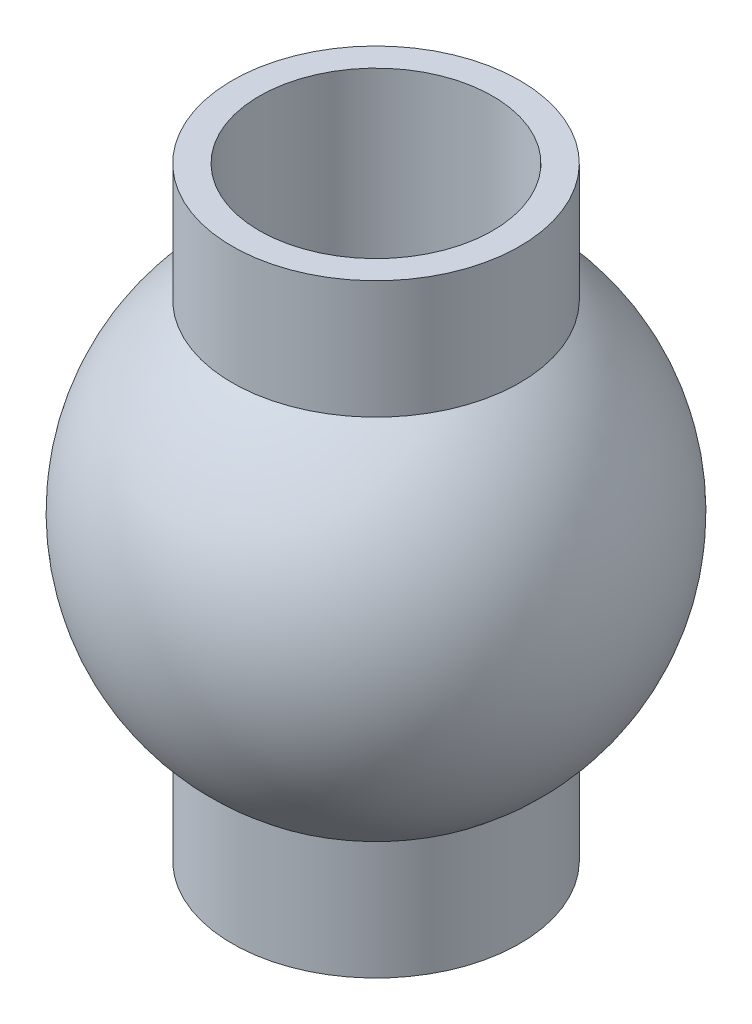
ISO-10303-21;
HEADER;
FILE_DESCRIPTION(('STEP AP214'),'2;1');
FILE_NAME('part.step','',(''),(''),'','','');
FILE_SCHEMA(('AUTOMOTIVE_DESIGN { 1 0 10303 214 1 1 1 1 }'));
ENDSEC;
DATA;
#1=APPLICATION_CONTEXT('core data for automotive mechanical design processes');
#2=APPLICATION_PROTOCOL_DEFINITION('international standard','automotive_design',2000,#1);
#3=PRODUCT_CONTEXT('',#1,'mechanical');
#4=PRODUCT('Part','Part','',(#3));
#5=PRODUCT_RELATED_PRODUCT_CATEGORY('part','',(#4));
#6=PRODUCT_DEFINITION_FORMATION('','',#4);
#7=PRODUCT_DEFINITION_CONTEXT('part definition',#1,'design');
#8=PRODUCT_DEFINITION('design','',#6,#7);
#9=PRODUCT_DEFINITION_SHAPE('','',#8);
#10=(LENGTH_UNIT() NAMED_UNIT(*) SI_UNIT(.MILLI.,.METRE.));
#11=(NAMED_UNIT(*) PLANE_ANGLE_UNIT() SI_UNIT($,.RADIAN.));
#12=(NAMED_UNIT(*) SI_UNIT($,.STERADIAN.) SOLID_ANGLE_UNIT());
#13=UNCERTAINTY_MEASURE_WITH_UNIT(LENGTH_MEASURE(1.E-05),#10,'distance_accuracy_value','');
#14=(GEOMETRIC_REPRESENTATION_CONTEXT(3) GLOBAL_UNCERTAINTY_ASSIGNED_CONTEXT((#13)) GLOBAL_UNIT_ASSIGNED_CONTEXT((#10,
#11,#12)) REPRESENTATION_CONTEXT('',''));
#15=CARTESIAN_POINT('',(0.,0.,0.));
#16=DIRECTION('',(0.,0.,1.));
#17=DIRECTION('',(1.,0.,0.));
#18=AXIS2_PLACEMENT_3D('',#15,#16,#17);
#19=CARTESIAN_POINT('',(2.23689332454051,0.,0.));
#20=DIRECTION('',(0.,-1.,0.));
#21=DIRECTION('',(0.,0.,-1.));
#22=AXIS2_PLACEMENT_3D('',#19,#20,#21);
#23=PLANE('',#22);
#24=CARTESIAN_POINT('',(0.,0.,0.));
#25=DIRECTION('',(0.,1.,0.));
#26=DIRECTION('',(0.,0.,1.));
#27=AXIS2_PLACEMENT_3D('',#24,#25,#26);
#28=CIRCLE('',#27,2.5);
#29=CARTESIAN_POINT('',(0.,0.,2.5));
#30=VERTEX_POINT('',#29);
#31=EDGE_CURVE('E51',#30,#30,#28,.T.);
#32=ORIENTED_EDGE('',*,*,#31,.T.);
#33=EDGE_LOOP('',(#32));
#34=FACE_BOUND('',#33,.T.);
#35=CARTESIAN_POINT('',(0.,0.,0.));
#36=DIRECTION('',(0.,-1.,0.));
#37=DIRECTION('',(0.,0.,-1.));
#38=AXIS2_PLACEMENT_3D('',#35,#36,#37);
#39=CIRCLE('',#38,3.08057016372045);
#40=CARTESIAN_POINT('',(0.,0.,-3.08057016372045));
#41=VERTEX_POINT('',#40);
#42=EDGE_CURVE('E10',#41,#41,#39,.T.);
#43=ORIENTED_EDGE('',*,*,#42,.T.);
#44=EDGE_LOOP('',(#43));
#45=FACE_BOUND('',#44,.T.);
#46=ADVANCED_FACE('F32',(#34,#45),#23,.T.);
#47=CARTESIAN_POINT('',(0.,0.,0.));
#48=DIRECTION('',(0.,-1.,0.));
#49=DIRECTION('',(0.,0.,-1.));
#50=AXIS2_PLACEMENT_3D('',#47,#48,#49);
#51=CYLINDRICAL_SURFACE('',#50,3.08057016372045);
#52=CARTESIAN_POINT('',(0.,2.53205016185087,0.));
#53=DIRECTION('',(0.,-1.,0.));
#54=DIRECTION('',(0.,0.,-1.));
#55=AXIS2_PLACEMENT_3D('',#52,#53,#54);
#56=CIRCLE('',#55,3.08057016372045);
#57=CARTESIAN_POINT('',(0.,2.53205016185087,-3.08057016372045));
#58=VERTEX_POINT('',#57);
#59=EDGE_CURVE('E38',#58,#58,#56,.T.);
#60=ORIENTED_EDGE('',*,*,#59,.T.);
#61=EDGE_LOOP('',(#60));
#62=FACE_BOUND('',#61,.T.);
#63=ORIENTED_EDGE('',*,*,#42,.F.);
#64=EDGE_LOOP('',(#63));
#65=FACE_BOUND('',#64,.T.);
#66=ADVANCED_FACE('F80',(#62,#65),#51,.T.);
#67=CARTESIAN_POINT('',(0.,6.470335,0.));
#68=DIRECTION('',(0.,-1.,0.));
#69=DIRECTION('',(1.,0.,0.));
#70=AXIS2_PLACEMENT_3D('',#67,#68,#69);
#71=SPHERICAL_SURFACE('',#70,5.);
#72=CARTESIAN_POINT('',(0.,10.4086198381491,0.));
#73=DIRECTION('',(0.,-1.,0.));
#74=DIRECTION('',(0.,0.,-1.));
#75=AXIS2_PLACEMENT_3D('',#72,#73,#74);
#76=CIRCLE('',#75,3.08057016372045);
#77=CARTESIAN_POINT('',(0.,10.4086198381491,-3.08057016372045));
#78=VERTEX_POINT('',#77);
#79=EDGE_CURVE('E42',#78,#78,#76,.T.);
#80=ORIENTED_EDGE('',*,*,#79,.T.);
#81=EDGE_LOOP('',(#80));
#82=FACE_BOUND('',#81,.T.);
#83=ORIENTED_EDGE('',*,*,#59,.F.);
#84=EDGE_LOOP('',(#83));
#85=FACE_BOUND('',#84,.T.);
#86=ADVANCED_FACE('F74',(#82,#85),#71,.T.);
#87=CARTESIAN_POINT('',(0.,0.,0.));
#88=DIRECTION('',(0.,-1.,0.));
#89=DIRECTION('',(0.,0.,-1.));
#90=AXIS2_PLACEMENT_3D('',#87,#88,#89);
#91=CYLINDRICAL_SURFACE('',#90,3.08057016372045);
#92=CARTESIAN_POINT('',(0.,12.94067,0.));
#93=DIRECTION('',(0.,-1.,0.));
#94=DIRECTION('',(0.,0.,-1.));
#95=AXIS2_PLACEMENT_3D('',#92,#93,#94);
#96=CIRCLE('',#95,3.08057016372045);
#97=CARTESIAN_POINT('',(0.,12.94067,-3.08057016372045));
#98=VERTEX_POINT('',#97);
#99=EDGE_CURVE('E46',#98,#98,#96,.T.);
#100=ORIENTED_EDGE('',*,*,#99,.T.);
#101=EDGE_LOOP('',(#100));
#102=FACE_BOUND('',#101,.T.);
#103=ORIENTED_EDGE('',*,*,#79,.F.);
#104=EDGE_LOOP('',(#103));
#105=FACE_BOUND('',#104,.T.);
#106=ADVANCED_FACE('F68',(#102,#105),#91,.T.);
#107=CARTESIAN_POINT('',(0.,12.94067,0.));
#108=DIRECTION('',(0.,1.,0.));
#109=DIRECTION('',(0.,0.,1.));
#110=AXIS2_PLACEMENT_3D('',#107,#108,#109);
#111=PLANE('',#110);
#112=CARTESIAN_POINT('',(0.,12.94067,0.));
#113=DIRECTION('',(0.,1.,0.));
#114=DIRECTION('',(0.,0.,1.));
#115=AXIS2_PLACEMENT_3D('',#112,#113,#114);
#116=CIRCLE('',#115,2.5);
#117=CARTESIAN_POINT('',(0.,12.94067,2.5));
#118=VERTEX_POINT('',#117);
#119=EDGE_CURVE('E52',#118,#118,#116,.T.);
#120=ORIENTED_EDGE('',*,*,#119,.F.);
#121=EDGE_LOOP('',(#120));
#122=FACE_BOUND('',#121,.T.);
#123=ORIENTED_EDGE('',*,*,#99,.F.);
#124=EDGE_LOOP('',(#123));
#125=FACE_BOUND('',#124,.T.);
#126=ADVANCED_FACE('F62',(#122,#125),#111,.T.);
#127=CARTESIAN_POINT('',(0.,0.,0.));
#128=DIRECTION('',(0.,1.,0.));
#129=DIRECTION('',(0.,0.,1.));
#130=AXIS2_PLACEMENT_3D('',#127,#128,#129);
#131=CYLINDRICAL_SURFACE('',#130,2.5);
#132=ORIENTED_EDGE('',*,*,#31,.F.);
#133=EDGE_LOOP('',(#132));
#134=FACE_BOUND('',#133,.T.);
#135=ORIENTED_EDGE('',*,*,#119,.T.);
#136=EDGE_LOOP('',(#135));
#137=FACE_BOUND('',#136,.T.);
#138=ADVANCED_FACE('F59',(#134,#137),#131,.F.);
#139=CLOSED_SHELL('',(#46,#66,#86,#106,#126,#138));
#140=MANIFOLD_SOLID_BREP('B2',#139);
#141=ADVANCED_BREP_SHAPE_REPRESENTATION('',(#18,#140),#14);
#142=SHAPE_DEFINITION_REPRESENTATION(#9,#141);
ENDSEC;
END-ISO-10303-21;
